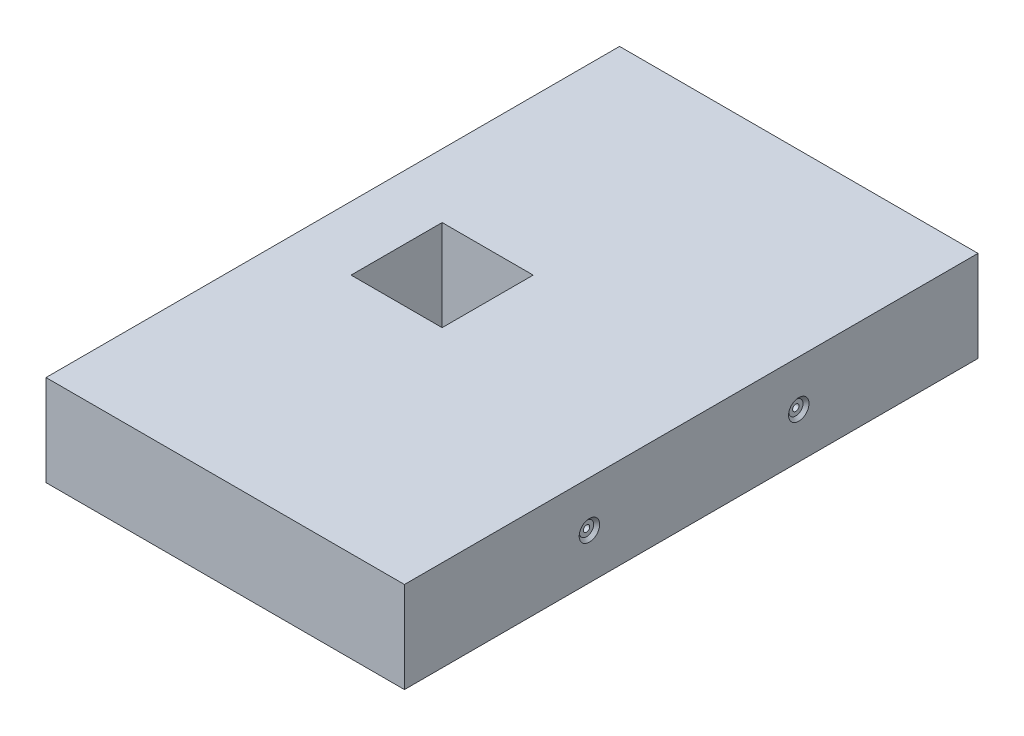
ISO-10303-21;
HEADER;
FILE_DESCRIPTION(('STEP AP214'),'2;1');
FILE_NAME('part.step','',(''),(''),'','','');
FILE_SCHEMA(('AUTOMOTIVE_DESIGN { 1 0 10303 214 1 1 1 1 }'));
ENDSEC;
DATA;
#1=APPLICATION_CONTEXT('core data for automotive mechanical design processes');
#2=APPLICATION_PROTOCOL_DEFINITION('international standard','automotive_design',2000,#1);
#3=PRODUCT_CONTEXT('',#1,'mechanical');
#4=PRODUCT('Part','Part','',(#3));
#5=PRODUCT_RELATED_PRODUCT_CATEGORY('part','',(#4));
#6=PRODUCT_DEFINITION_FORMATION('','',#4);
#7=PRODUCT_DEFINITION_CONTEXT('part definition',#1,'design');
#8=PRODUCT_DEFINITION('design','',#6,#7);
#9=PRODUCT_DEFINITION_SHAPE('','',#8);
#10=(LENGTH_UNIT() NAMED_UNIT(*) SI_UNIT(.MILLI.,.METRE.));
#11=(NAMED_UNIT(*) PLANE_ANGLE_UNIT() SI_UNIT($,.RADIAN.));
#12=(NAMED_UNIT(*) SI_UNIT($,.STERADIAN.) SOLID_ANGLE_UNIT());
#13=UNCERTAINTY_MEASURE_WITH_UNIT(LENGTH_MEASURE(1.E-05),#10,'distance_accuracy_value','');
#14=(GEOMETRIC_REPRESENTATION_CONTEXT(3) GLOBAL_UNCERTAINTY_ASSIGNED_CONTEXT((#13)) GLOBAL_UNIT_ASSIGNED_CONTEXT((#10,
#11,#12)) REPRESENTATION_CONTEXT('',''));
#15=CARTESIAN_POINT('',(0.,0.,0.));
#16=DIRECTION('',(0.,0.,1.));
#17=DIRECTION('',(1.,0.,0.));
#18=AXIS2_PLACEMENT_3D('',#15,#16,#17);
#19=CARTESIAN_POINT('',(0.,25.4,0.));
#20=DIRECTION('',(0.,1.,0.));
#21=DIRECTION('',(0.,0.,1.));
#22=AXIS2_PLACEMENT_3D('',#19,#20,#21);
#23=PLANE('',#22);
#24=DIRECTION('',(0.,0.,-1.));
#25=VECTOR('',#24,1.);
#26=CARTESIAN_POINT('',(50.,25.4,-80.));
#27=LINE('',#26,#25);
#28=CARTESIAN_POINT('',(50.,25.4,80.));
#29=VERTEX_POINT('',#28);
#30=CARTESIAN_POINT('',(50.,25.4,-80.));
#31=VERTEX_POINT('',#30);
#32=EDGE_CURVE('E163',#29,#31,#27,.T.);
#33=ORIENTED_EDGE('',*,*,#32,.T.);
#34=DIRECTION('',(-1.,0.,0.));
#35=VECTOR('',#34,1.);
#36=CARTESIAN_POINT('',(-50.,25.4,-80.));
#37=LINE('',#36,#35);
#38=CARTESIAN_POINT('',(-50.,25.4,-80.));
#39=VERTEX_POINT('',#38);
#40=EDGE_CURVE('E166',#31,#39,#37,.T.);
#41=ORIENTED_EDGE('',*,*,#40,.T.);
#42=DIRECTION('',(0.,0.,1.));
#43=VECTOR('',#42,1.);
#44=CARTESIAN_POINT('',(-50.,25.4,-80.));
#45=LINE('',#44,#43);
#46=CARTESIAN_POINT('',(-50.,25.4,80.));
#47=VERTEX_POINT('',#46);
#48=EDGE_CURVE('E169',#39,#47,#45,.T.);
#49=ORIENTED_EDGE('',*,*,#48,.T.);
#50=DIRECTION('',(1.,0.,0.));
#51=VECTOR('',#50,1.);
#52=CARTESIAN_POINT('',(-50.,25.4,80.));
#53=LINE('',#52,#51);
#54=EDGE_CURVE('E171',#47,#29,#53,.T.);
#55=ORIENTED_EDGE('',*,*,#54,.T.);
#56=EDGE_LOOP('',(#33,#41,#49,#55));
#57=FACE_BOUND('',#56,.T.);
#58=DIRECTION('',(-1.,0.,0.));
#59=VECTOR('',#58,1.);
#60=CARTESIAN_POINT('',(-32.19,25.4,-12.7));
#61=LINE('',#60,#59);
#62=CARTESIAN_POINT('',(-6.79,25.4,-12.7));
#63=VERTEX_POINT('',#62);
#64=CARTESIAN_POINT('',(-32.19,25.4,-12.7));
#65=VERTEX_POINT('',#64);
#66=EDGE_CURVE('E139',#63,#65,#61,.T.);
#67=ORIENTED_EDGE('',*,*,#66,.F.);
#68=DIRECTION('',(0.,0.,-1.));
#69=VECTOR('',#68,1.);
#70=CARTESIAN_POINT('',(-6.79,25.4,-12.7));
#71=LINE('',#70,#69);
#72=CARTESIAN_POINT('',(-6.79,25.4,12.7));
#73=VERTEX_POINT('',#72);
#74=EDGE_CURVE('E137',#73,#63,#71,.T.);
#75=ORIENTED_EDGE('',*,*,#74,.F.);
#76=DIRECTION('',(1.,0.,0.));
#77=VECTOR('',#76,1.);
#78=CARTESIAN_POINT('',(-32.19,25.4,12.7));
#79=LINE('',#78,#77);
#80=CARTESIAN_POINT('',(-32.19,25.4,12.7));
#81=VERTEX_POINT('',#80);
#82=EDGE_CURVE('E144',#81,#73,#79,.T.);
#83=ORIENTED_EDGE('',*,*,#82,.F.);
#84=DIRECTION('',(0.,0.,1.));
#85=VECTOR('',#84,1.);
#86=CARTESIAN_POINT('',(-32.19,25.4,-12.7));
#87=LINE('',#86,#85);
#88=EDGE_CURVE('E142',#65,#81,#87,.T.);
#89=ORIENTED_EDGE('',*,*,#88,.F.);
#90=EDGE_LOOP('',(#67,#75,#83,#89));
#91=FACE_BOUND('',#90,.T.);
#92=ADVANCED_FACE('F34',(#57,#91),#23,.T.);
#93=CARTESIAN_POINT('',(0.,0.,0.));
#94=DIRECTION('',(0.,1.,0.));
#95=DIRECTION('',(0.,0.,1.));
#96=AXIS2_PLACEMENT_3D('',#93,#94,#95);
#97=PLANE('',#96);
#98=DIRECTION('',(0.,0.,-1.));
#99=VECTOR('',#98,1.);
#100=CARTESIAN_POINT('',(50.,0.,-80.));
#101=LINE('',#100,#99);
#102=CARTESIAN_POINT('',(50.,0.,80.));
#103=VERTEX_POINT('',#102);
#104=CARTESIAN_POINT('',(50.,0.,-80.));
#105=VERTEX_POINT('',#104);
#106=EDGE_CURVE('E162',#103,#105,#101,.T.);
#107=ORIENTED_EDGE('',*,*,#106,.F.);
#108=DIRECTION('',(1.,0.,0.));
#109=VECTOR('',#108,1.);
#110=CARTESIAN_POINT('',(-50.,0.,80.));
#111=LINE('',#110,#109);
#112=CARTESIAN_POINT('',(-50.,0.,80.));
#113=VERTEX_POINT('',#112);
#114=EDGE_CURVE('E167',#113,#103,#111,.T.);
#115=ORIENTED_EDGE('',*,*,#114,.F.);
#116=DIRECTION('',(0.,0.,1.));
#117=VECTOR('',#116,1.);
#118=CARTESIAN_POINT('',(-50.,0.,-80.));
#119=LINE('',#118,#117);
#120=CARTESIAN_POINT('',(-50.,0.,-80.));
#121=VERTEX_POINT('',#120);
#122=EDGE_CURVE('E178',#121,#113,#119,.T.);
#123=ORIENTED_EDGE('',*,*,#122,.F.);
#124=DIRECTION('',(-1.,0.,0.));
#125=VECTOR('',#124,1.);
#126=CARTESIAN_POINT('',(-50.,0.,-80.));
#127=LINE('',#126,#125);
#128=EDGE_CURVE('E176',#105,#121,#127,.T.);
#129=ORIENTED_EDGE('',*,*,#128,.F.);
#130=EDGE_LOOP('',(#107,#115,#123,#129));
#131=FACE_BOUND('',#130,.T.);
#132=DIRECTION('',(0.,0.,-1.));
#133=VECTOR('',#132,1.);
#134=CARTESIAN_POINT('',(-6.79,0.,-12.7));
#135=LINE('',#134,#133);
#136=CARTESIAN_POINT('',(-6.79,0.,12.7));
#137=VERTEX_POINT('',#136);
#138=CARTESIAN_POINT('',(-6.79,0.,-12.7));
#139=VERTEX_POINT('',#138);
#140=EDGE_CURVE('E57',#137,#139,#135,.T.);
#141=ORIENTED_EDGE('',*,*,#140,.T.);
#142=DIRECTION('',(-1.,0.,0.));
#143=VECTOR('',#142,1.);
#144=CARTESIAN_POINT('',(-32.19,0.,-12.7));
#145=LINE('',#144,#143);
#146=CARTESIAN_POINT('',(-32.19,0.,-12.7));
#147=VERTEX_POINT('',#146);
#148=EDGE_CURVE('E148',#139,#147,#145,.T.);
#149=ORIENTED_EDGE('',*,*,#148,.T.);
#150=DIRECTION('',(0.,0.,1.));
#151=VECTOR('',#150,1.);
#152=CARTESIAN_POINT('',(-32.19,0.,-12.7));
#153=LINE('',#152,#151);
#154=CARTESIAN_POINT('',(-32.19,0.,12.7));
#155=VERTEX_POINT('',#154);
#156=EDGE_CURVE('E151',#147,#155,#153,.T.);
#157=ORIENTED_EDGE('',*,*,#156,.T.);
#158=DIRECTION('',(1.,0.,0.));
#159=VECTOR('',#158,1.);
#160=CARTESIAN_POINT('',(-32.19,0.,12.7));
#161=LINE('',#160,#159);
#162=EDGE_CURVE('E140',#155,#137,#161,.T.);
#163=ORIENTED_EDGE('',*,*,#162,.T.);
#164=EDGE_LOOP('',(#141,#149,#157,#163));
#165=FACE_BOUND('',#164,.T.);
#166=ADVANCED_FACE('F196',(#131,#165),#97,.F.);
#167=CARTESIAN_POINT('',(50.,25.4,-80.));
#168=DIRECTION('',(-1.,0.,0.));
#169=DIRECTION('',(0.,0.,1.));
#170=AXIS2_PLACEMENT_3D('',#167,#168,#169);
#171=PLANE('',#170);
#172=CARTESIAN_POINT('',(50.,12.7,28.4));
#173=DIRECTION('',(1.,0.,0.));
#174=DIRECTION('',(0.,0.,-1.));
#175=AXIS2_PLACEMENT_3D('',#172,#173,#174);
#176=CIRCLE('',#175,2.8575);
#177=CARTESIAN_POINT('',(50.,12.7,25.5425));
#178=VERTEX_POINT('',#177);
#179=EDGE_CURVE('E284',#178,#178,#176,.T.);
#180=ORIENTED_EDGE('',*,*,#179,.F.);
#181=EDGE_LOOP('',(#180));
#182=FACE_BOUND('',#181,.T.);
#183=CARTESIAN_POINT('',(50.,12.7,-30.));
#184=DIRECTION('',(1.,0.,0.));
#185=DIRECTION('',(0.,0.,-1.));
#186=AXIS2_PLACEMENT_3D('',#183,#184,#185);
#187=CIRCLE('',#186,2.8575);
#188=CARTESIAN_POINT('',(50.,12.7,-32.8575));
#189=VERTEX_POINT('',#188);
#190=EDGE_CURVE('E115',#189,#189,#187,.T.);
#191=ORIENTED_EDGE('',*,*,#190,.F.);
#192=EDGE_LOOP('',(#191));
#193=FACE_BOUND('',#192,.T.);
#194=ORIENTED_EDGE('',*,*,#106,.T.);
#195=DIRECTION('',(0.,-1.,0.));
#196=VECTOR('',#195,1.);
#197=CARTESIAN_POINT('',(50.,25.4,-80.));
#198=LINE('',#197,#196);
#199=EDGE_CURVE('E11',#31,#105,#198,.T.);
#200=ORIENTED_EDGE('',*,*,#199,.F.);
#201=ORIENTED_EDGE('',*,*,#32,.F.);
#202=DIRECTION('',(0.,-1.,0.));
#203=VECTOR('',#202,1.);
#204=CARTESIAN_POINT('',(50.,25.4,80.));
#205=LINE('',#204,#203);
#206=EDGE_CURVE('E173',#29,#103,#205,.T.);
#207=ORIENTED_EDGE('',*,*,#206,.T.);
#208=EDGE_LOOP('',(#194,#200,#201,#207));
#209=FACE_BOUND('',#208,.T.);
#210=ADVANCED_FACE('F36',(#182,#193,#209),#171,.F.);
#211=CARTESIAN_POINT('',(-50.,25.4,-80.));
#212=DIRECTION('',(0.,0.,1.));
#213=DIRECTION('',(1.,0.,0.));
#214=AXIS2_PLACEMENT_3D('',#211,#212,#213);
#215=PLANE('',#214);
#216=ORIENTED_EDGE('',*,*,#128,.T.);
#217=DIRECTION('',(0.,-1.,0.));
#218=VECTOR('',#217,1.);
#219=CARTESIAN_POINT('',(-50.,25.4,-80.));
#220=LINE('',#219,#218);
#221=EDGE_CURVE('E42',#39,#121,#220,.T.);
#222=ORIENTED_EDGE('',*,*,#221,.F.);
#223=ORIENTED_EDGE('',*,*,#40,.F.);
#224=ORIENTED_EDGE('',*,*,#199,.T.);
#225=EDGE_LOOP('',(#216,#222,#223,#224));
#226=FACE_BOUND('',#225,.T.);
#227=ADVANCED_FACE('F207',(#226),#215,.F.);
#228=CARTESIAN_POINT('',(-50.,25.4,-80.));
#229=DIRECTION('',(1.,0.,0.));
#230=DIRECTION('',(0.,0.,-1.));
#231=AXIS2_PLACEMENT_3D('',#228,#229,#230);
#232=PLANE('',#231);
#233=ORIENTED_EDGE('',*,*,#122,.T.);
#234=DIRECTION('',(0.,-1.,0.));
#235=VECTOR('',#234,1.);
#236=CARTESIAN_POINT('',(-50.,25.4,80.));
#237=LINE('',#236,#235);
#238=EDGE_CURVE('E183',#47,#113,#237,.T.);
#239=ORIENTED_EDGE('',*,*,#238,.F.);
#240=ORIENTED_EDGE('',*,*,#48,.F.);
#241=ORIENTED_EDGE('',*,*,#221,.T.);
#242=EDGE_LOOP('',(#233,#239,#240,#241));
#243=FACE_BOUND('',#242,.T.);
#244=ADVANCED_FACE('F190',(#243),#232,.F.);
#245=CARTESIAN_POINT('',(-50.,25.4,80.));
#246=DIRECTION('',(0.,0.,-1.));
#247=DIRECTION('',(-1.,0.,0.));
#248=AXIS2_PLACEMENT_3D('',#245,#246,#247);
#249=PLANE('',#248);
#250=ORIENTED_EDGE('',*,*,#114,.T.);
#251=ORIENTED_EDGE('',*,*,#206,.F.);
#252=ORIENTED_EDGE('',*,*,#54,.F.);
#253=ORIENTED_EDGE('',*,*,#238,.T.);
#254=EDGE_LOOP('',(#250,#251,#252,#253));
#255=FACE_BOUND('',#254,.T.);
#256=ADVANCED_FACE('F200',(#255),#249,.F.);
#257=CARTESIAN_POINT('',(-6.79,25.4,-12.7));
#258=DIRECTION('',(-1.,0.,0.));
#259=DIRECTION('',(0.,0.,1.));
#260=AXIS2_PLACEMENT_3D('',#257,#258,#259);
#261=PLANE('',#260);
#262=ORIENTED_EDGE('',*,*,#140,.F.);
#263=DIRECTION('',(0.,-1.,0.));
#264=VECTOR('',#263,1.);
#265=CARTESIAN_POINT('',(-6.79,25.4,12.7));
#266=LINE('',#265,#264);
#267=EDGE_CURVE('E146',#73,#137,#266,.T.);
#268=ORIENTED_EDGE('',*,*,#267,.F.);
#269=ORIENTED_EDGE('',*,*,#74,.T.);
#270=DIRECTION('',(0.,-1.,0.));
#271=VECTOR('',#270,1.);
#272=CARTESIAN_POINT('',(-6.79,25.4,-12.7));
#273=LINE('',#272,#271);
#274=EDGE_CURVE('E160',#63,#139,#273,.T.);
#275=ORIENTED_EDGE('',*,*,#274,.T.);
#276=EDGE_LOOP('',(#262,#268,#269,#275));
#277=FACE_BOUND('',#276,.T.);
#278=ADVANCED_FACE('F222',(#277),#261,.T.);
#279=CARTESIAN_POINT('',(-32.19,25.4,-12.7));
#280=DIRECTION('',(0.,0.,1.));
#281=DIRECTION('',(1.,0.,0.));
#282=AXIS2_PLACEMENT_3D('',#279,#280,#281);
#283=PLANE('',#282);
#284=ORIENTED_EDGE('',*,*,#148,.F.);
#285=ORIENTED_EDGE('',*,*,#274,.F.);
#286=ORIENTED_EDGE('',*,*,#66,.T.);
#287=DIRECTION('',(0.,-1.,0.));
#288=VECTOR('',#287,1.);
#289=CARTESIAN_POINT('',(-32.19,25.4,-12.7));
#290=LINE('',#289,#288);
#291=EDGE_CURVE('E158',#65,#147,#290,.T.);
#292=ORIENTED_EDGE('',*,*,#291,.T.);
#293=EDGE_LOOP('',(#284,#285,#286,#292));
#294=FACE_BOUND('',#293,.T.);
#295=ADVANCED_FACE('F229',(#294),#283,.T.);
#296=CARTESIAN_POINT('',(-32.19,25.4,-12.7));
#297=DIRECTION('',(1.,0.,0.));
#298=DIRECTION('',(0.,0.,-1.));
#299=AXIS2_PLACEMENT_3D('',#296,#297,#298);
#300=PLANE('',#299);
#301=ORIENTED_EDGE('',*,*,#156,.F.);
#302=ORIENTED_EDGE('',*,*,#291,.F.);
#303=ORIENTED_EDGE('',*,*,#88,.T.);
#304=DIRECTION('',(0.,-1.,0.));
#305=VECTOR('',#304,1.);
#306=CARTESIAN_POINT('',(-32.19,25.4,12.7));
#307=LINE('',#306,#305);
#308=EDGE_CURVE('E49',#81,#155,#307,.T.);
#309=ORIENTED_EDGE('',*,*,#308,.T.);
#310=EDGE_LOOP('',(#301,#302,#303,#309));
#311=FACE_BOUND('',#310,.T.);
#312=ADVANCED_FACE('F233',(#311),#300,.T.);
#313=CARTESIAN_POINT('',(-32.19,25.4,12.7));
#314=DIRECTION('',(0.,0.,-1.));
#315=DIRECTION('',(-1.,0.,0.));
#316=AXIS2_PLACEMENT_3D('',#313,#314,#315);
#317=PLANE('',#316);
#318=ORIENTED_EDGE('',*,*,#162,.F.);
#319=ORIENTED_EDGE('',*,*,#308,.F.);
#320=ORIENTED_EDGE('',*,*,#82,.T.);
#321=ORIENTED_EDGE('',*,*,#267,.T.);
#322=EDGE_LOOP('',(#318,#319,#320,#321));
#323=FACE_BOUND('',#322,.T.);
#324=ADVANCED_FACE('F238',(#323),#317,.T.);
#325=CARTESIAN_POINT('',(20.,12.7,-30.));
#326=DIRECTION('',(1.,0.,0.));
#327=DIRECTION('',(0.,0.,-1.));
#328=AXIS2_PLACEMENT_3D('',#325,#326,#327);
#329=CONICAL_SURFACE('',#328,0.888999999999992,1.02974425867665);
#330=CARTESIAN_POINT('',(19.4658349096845,12.7,-30.));
#331=VERTEX_POINT('',#330);
#332=VERTEX_LOOP('',#331);
#333=FACE_BOUND('',#332,.T.);
#334=CARTESIAN_POINT('',(20.,12.7,-30.));
#335=DIRECTION('',(1.,0.,0.));
#336=DIRECTION('',(0.,0.,-1.));
#337=AXIS2_PLACEMENT_3D('',#334,#335,#336);
#338=CIRCLE('',#337,0.888999999999992);
#339=CARTESIAN_POINT('',(20.,12.7,-30.889));
#340=VERTEX_POINT('',#339);
#341=EDGE_CURVE('E134',#340,#340,#338,.T.);
#342=ORIENTED_EDGE('',*,*,#341,.T.);
#343=EDGE_LOOP('',(#342));
#344=FACE_BOUND('',#343,.T.);
#345=ADVANCED_FACE('F244',(#333,#344),#329,.F.);
#346=CARTESIAN_POINT('',(50.,12.7,-30.));
#347=DIRECTION('',(1.,0.,0.));
#348=DIRECTION('',(0.,0.,-1.));
#349=AXIS2_PLACEMENT_3D('',#346,#347,#348);
#350=CYLINDRICAL_SURFACE('',#349,0.888999999999994);
#351=ORIENTED_EDGE('',*,*,#341,.F.);
#352=EDGE_LOOP('',(#351));
#353=FACE_BOUND('',#352,.T.);
#354=CARTESIAN_POINT('',(49.1872,12.7,-30.));
#355=DIRECTION('',(1.,0.,0.));
#356=DIRECTION('',(0.,0.,-1.));
#357=AXIS2_PLACEMENT_3D('',#354,#355,#356);
#358=CIRCLE('',#357,0.888999999999996);
#359=CARTESIAN_POINT('',(49.1872,12.7,-30.889));
#360=VERTEX_POINT('',#359);
#361=EDGE_CURVE('E131',#360,#360,#358,.T.);
#362=ORIENTED_EDGE('',*,*,#361,.T.);
#363=EDGE_LOOP('',(#362));
#364=FACE_BOUND('',#363,.T.);
#365=ADVANCED_FACE('F247',(#353,#364),#350,.F.);
#366=CARTESIAN_POINT('',(49.1872,13.589,-30.));
#367=DIRECTION('',(-1.,0.,0.));
#368=DIRECTION('',(0.,0.,1.));
#369=AXIS2_PLACEMENT_3D('',#366,#367,#368);
#370=PLANE('',#369);
#371=ORIENTED_EDGE('',*,*,#361,.F.);
#372=EDGE_LOOP('',(#371));
#373=FACE_BOUND('',#372,.T.);
#374=CARTESIAN_POINT('',(49.1872,12.7,-30.));
#375=DIRECTION('',(1.,0.,0.));
#376=DIRECTION('',(0.,0.,-1.));
#377=AXIS2_PLACEMENT_3D('',#374,#375,#376);
#378=CIRCLE('',#377,1.98501);
#379=CARTESIAN_POINT('',(49.1872,12.7,-31.98501));
#380=VERTEX_POINT('',#379);
#381=EDGE_CURVE('E128',#380,#380,#378,.T.);
#382=ORIENTED_EDGE('',*,*,#381,.T.);
#383=EDGE_LOOP('',(#382));
#384=FACE_BOUND('',#383,.T.);
#385=ADVANCED_FACE('F251',(#373,#384),#370,.F.);
#386=CARTESIAN_POINT('',(50.,12.7,-30.));
#387=DIRECTION('',(1.,0.,0.));
#388=DIRECTION('',(0.,0.,-1.));
#389=AXIS2_PLACEMENT_3D('',#386,#387,#388);
#390=CYLINDRICAL_SURFACE('',#389,1.98501);
#391=ORIENTED_EDGE('',*,*,#381,.F.);
#392=EDGE_LOOP('',(#391));
#393=FACE_BOUND('',#392,.T.);
#394=CARTESIAN_POINT('',(49.12751,12.7,-30.));
#395=DIRECTION('',(1.,0.,0.));
#396=DIRECTION('',(0.,0.,-1.));
#397=AXIS2_PLACEMENT_3D('',#394,#395,#396);
#398=CIRCLE('',#397,1.98501);
#399=CARTESIAN_POINT('',(49.12751,12.7,-31.98501));
#400=VERTEX_POINT('',#399);
#401=EDGE_CURVE('E119',#400,#400,#398,.T.);
#402=ORIENTED_EDGE('',*,*,#401,.T.);
#403=EDGE_LOOP('',(#402));
#404=FACE_BOUND('',#403,.T.);
#405=ADVANCED_FACE('F255',(#393,#404),#390,.T.);
#406=CARTESIAN_POINT('',(50.,12.7,-30.));
#407=DIRECTION('',(1.,0.,0.));
#408=DIRECTION('',(0.,0.,-1.));
#409=AXIS2_PLACEMENT_3D('',#406,#407,#408);
#410=CONICAL_SURFACE('',#409,2.8575,0.785398163397449);
#411=ORIENTED_EDGE('',*,*,#401,.F.);
#412=EDGE_LOOP('',(#411));
#413=FACE_BOUND('',#412,.T.);
#414=ORIENTED_EDGE('',*,*,#190,.T.);
#415=EDGE_LOOP('',(#414));
#416=FACE_BOUND('',#415,.T.);
#417=ADVANCED_FACE('F109',(#413,#416),#410,.F.);
#418=CARTESIAN_POINT('',(20.,12.7,28.4));
#419=DIRECTION('',(1.,0.,0.));
#420=DIRECTION('',(0.,0.,-1.));
#421=AXIS2_PLACEMENT_3D('',#418,#419,#420);
#422=CONICAL_SURFACE('',#421,0.888999999999992,1.02974425867665);
#423=CARTESIAN_POINT('',(19.4658349096845,12.7,28.4));
#424=VERTEX_POINT('',#423);
#425=VERTEX_LOOP('',#424);
#426=FACE_BOUND('',#425,.T.);
#427=CARTESIAN_POINT('',(20.,12.7,28.4));
#428=DIRECTION('',(1.,0.,0.));
#429=DIRECTION('',(0.,0.,-1.));
#430=AXIS2_PLACEMENT_3D('',#427,#428,#429);
#431=CIRCLE('',#430,0.888999999999992);
#432=CARTESIAN_POINT('',(20.,12.7,27.511));
#433=VERTEX_POINT('',#432);
#434=EDGE_CURVE('E113',#433,#433,#431,.T.);
#435=ORIENTED_EDGE('',*,*,#434,.T.);
#436=EDGE_LOOP('',(#435));
#437=FACE_BOUND('',#436,.T.);
#438=ADVANCED_FACE('F105',(#426,#437),#422,.F.);
#439=CARTESIAN_POINT('',(50.,12.7,28.4));
#440=DIRECTION('',(1.,0.,0.));
#441=DIRECTION('',(0.,0.,-1.));
#442=AXIS2_PLACEMENT_3D('',#439,#440,#441);
#443=CYLINDRICAL_SURFACE('',#442,0.888999999999994);
#444=ORIENTED_EDGE('',*,*,#434,.F.);
#445=EDGE_LOOP('',(#444));
#446=FACE_BOUND('',#445,.T.);
#447=CARTESIAN_POINT('',(49.1872,12.7,28.4));
#448=DIRECTION('',(1.,0.,0.));
#449=DIRECTION('',(0.,0.,-1.));
#450=AXIS2_PLACEMENT_3D('',#447,#448,#449);
#451=CIRCLE('',#450,0.888999999999996);
#452=CARTESIAN_POINT('',(49.1872,12.7,27.511));
#453=VERTEX_POINT('',#452);
#454=EDGE_CURVE('E116',#453,#453,#451,.T.);
#455=ORIENTED_EDGE('',*,*,#454,.T.);
#456=EDGE_LOOP('',(#455));
#457=FACE_BOUND('',#456,.T.);
#458=ADVANCED_FACE('F108',(#446,#457),#443,.F.);
#459=CARTESIAN_POINT('',(49.1872,13.589,28.4));
#460=DIRECTION('',(-1.,0.,0.));
#461=DIRECTION('',(0.,0.,1.));
#462=AXIS2_PLACEMENT_3D('',#459,#460,#461);
#463=PLANE('',#462);
#464=ORIENTED_EDGE('',*,*,#454,.F.);
#465=EDGE_LOOP('',(#464));
#466=FACE_BOUND('',#465,.T.);
#467=CARTESIAN_POINT('',(49.1872,12.7,28.4));
#468=DIRECTION('',(1.,0.,0.));
#469=DIRECTION('',(0.,0.,-1.));
#470=AXIS2_PLACEMENT_3D('',#467,#468,#469);
#471=CIRCLE('',#470,1.98501);
#472=CARTESIAN_POINT('',(49.1872,12.7,26.41499));
#473=VERTEX_POINT('',#472);
#474=EDGE_CURVE('E122',#473,#473,#471,.T.);
#475=ORIENTED_EDGE('',*,*,#474,.T.);
#476=EDGE_LOOP('',(#475));
#477=FACE_BOUND('',#476,.T.);
#478=ADVANCED_FACE('F265',(#466,#477),#463,.F.);
#479=CARTESIAN_POINT('',(50.,12.7,28.4));
#480=DIRECTION('',(1.,0.,0.));
#481=DIRECTION('',(0.,0.,-1.));
#482=AXIS2_PLACEMENT_3D('',#479,#480,#481);
#483=CYLINDRICAL_SURFACE('',#482,1.98501);
#484=ORIENTED_EDGE('',*,*,#474,.F.);
#485=EDGE_LOOP('',(#484));
#486=FACE_BOUND('',#485,.T.);
#487=CARTESIAN_POINT('',(49.12751,12.7,28.4));
#488=DIRECTION('',(1.,0.,0.));
#489=DIRECTION('',(0.,0.,-1.));
#490=AXIS2_PLACEMENT_3D('',#487,#488,#489);
#491=CIRCLE('',#490,1.98501);
#492=CARTESIAN_POINT('',(49.12751,12.7,26.41499));
#493=VERTEX_POINT('',#492);
#494=EDGE_CURVE('E281',#493,#493,#491,.T.);
#495=ORIENTED_EDGE('',*,*,#494,.T.);
#496=EDGE_LOOP('',(#495));
#497=FACE_BOUND('',#496,.T.);
#498=ADVANCED_FACE('F268',(#486,#497),#483,.T.);
#499=CARTESIAN_POINT('',(50.,12.7,28.4));
#500=DIRECTION('',(1.,0.,0.));
#501=DIRECTION('',(0.,0.,-1.));
#502=AXIS2_PLACEMENT_3D('',#499,#500,#501);
#503=CONICAL_SURFACE('',#502,2.8575,0.785398163397449);
#504=ORIENTED_EDGE('',*,*,#494,.F.);
#505=EDGE_LOOP('',(#504));
#506=FACE_BOUND('',#505,.T.);
#507=ORIENTED_EDGE('',*,*,#179,.T.);
#508=EDGE_LOOP('',(#507));
#509=FACE_BOUND('',#508,.T.);
#510=ADVANCED_FACE('F272',(#506,#509),#503,.F.);
#511=CLOSED_SHELL('',(#92,#166,#210,#227,#244,#256,#278,#295,#312,#324,#345,#365,#385,#405,#417,
#438,#458,#478,#498,#510));
#512=MANIFOLD_SOLID_BREP('B2',#511);
#513=ADVANCED_BREP_SHAPE_REPRESENTATION('',(#18,#512),#14);
#514=SHAPE_DEFINITION_REPRESENTATION(#9,#513);
ENDSEC;
END-ISO-10303-21;
